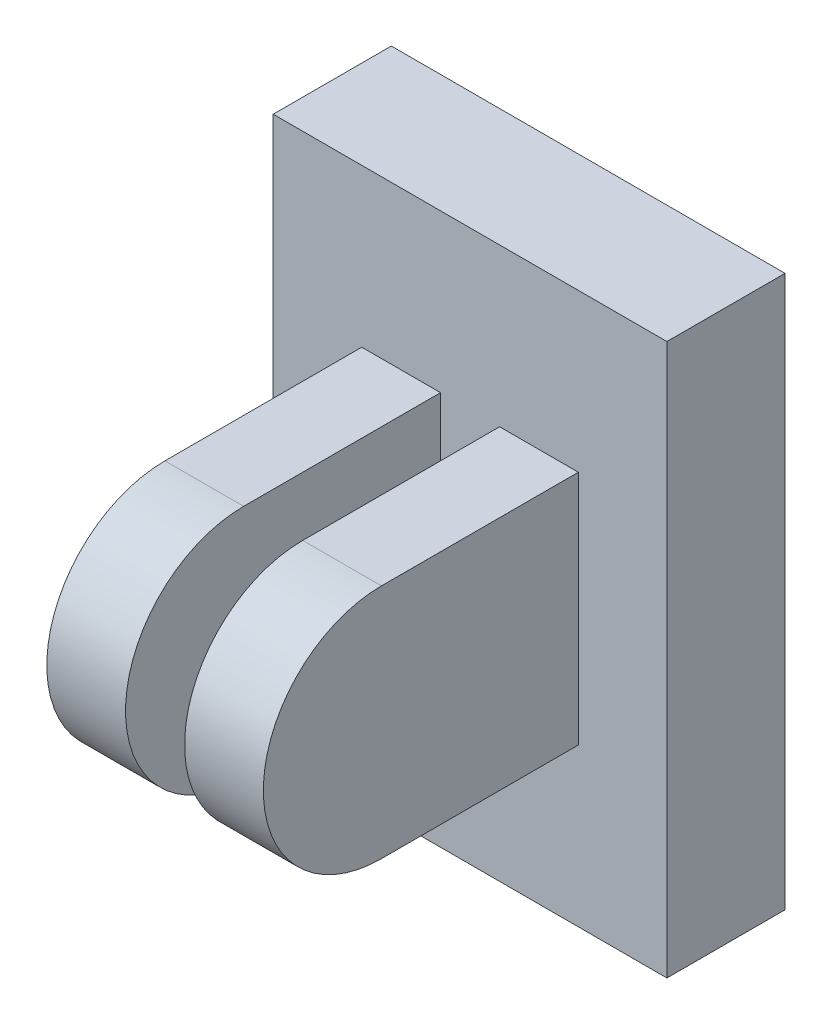
ISO-10303-21;
HEADER;
FILE_DESCRIPTION(('STEP AP214'),'2;1');
FILE_NAME('part.step','',(''),(''),'','','');
FILE_SCHEMA(('AUTOMOTIVE_DESIGN { 1 0 10303 214 1 1 1 1 }'));
ENDSEC;
DATA;
#1=APPLICATION_CONTEXT('core data for automotive mechanical design processes');
#2=APPLICATION_PROTOCOL_DEFINITION('international standard','automotive_design',2000,#1);
#3=PRODUCT_CONTEXT('',#1,'mechanical');
#4=PRODUCT('Part','Part','',(#3));
#5=PRODUCT_RELATED_PRODUCT_CATEGORY('part','',(#4));
#6=PRODUCT_DEFINITION_FORMATION('','',#4);
#7=PRODUCT_DEFINITION_CONTEXT('part definition',#1,'design');
#8=PRODUCT_DEFINITION('design','',#6,#7);
#9=PRODUCT_DEFINITION_SHAPE('','',#8);
#10=(LENGTH_UNIT() NAMED_UNIT(*) SI_UNIT(.MILLI.,.METRE.));
#11=(NAMED_UNIT(*) PLANE_ANGLE_UNIT() SI_UNIT($,.RADIAN.));
#12=(NAMED_UNIT(*) SI_UNIT($,.STERADIAN.) SOLID_ANGLE_UNIT());
#13=UNCERTAINTY_MEASURE_WITH_UNIT(LENGTH_MEASURE(1.E-05),#10,'distance_accuracy_value','');
#14=(GEOMETRIC_REPRESENTATION_CONTEXT(3) GLOBAL_UNCERTAINTY_ASSIGNED_CONTEXT((#13)) GLOBAL_UNIT_ASSIGNED_CONTEXT((#10,
#11,#12)) REPRESENTATION_CONTEXT('',''));
#15=CARTESIAN_POINT('',(0.,0.,0.));
#16=DIRECTION('',(0.,0.,1.));
#17=DIRECTION('',(1.,0.,0.));
#18=AXIS2_PLACEMENT_3D('',#15,#16,#17);
#19=CARTESIAN_POINT('',(4.365625,0.,12.7));
#20=DIRECTION('',(-1.,0.,0.));
#21=DIRECTION('',(0.,0.,1.));
#22=AXIS2_PLACEMENT_3D('',#19,#20,#21);
#23=CYLINDRICAL_SURFACE('',#22,4.7625);
#24=CARTESIAN_POINT('',(1.190625,0.,12.7));
#25=DIRECTION('',(-1.,0.,0.));
#26=DIRECTION('',(0.,0.,1.));
#27=AXIS2_PLACEMENT_3D('',#24,#25,#26);
#28=CIRCLE('',#27,4.7625);
#29=CARTESIAN_POINT('',(1.190625,-4.7625,12.7));
#30=VERTEX_POINT('',#29);
#31=CARTESIAN_POINT('',(1.190625,4.7625,12.7));
#32=VERTEX_POINT('',#31);
#33=EDGE_CURVE('E33',#30,#32,#28,.T.);
#34=ORIENTED_EDGE('',*,*,#33,.F.);
#35=DIRECTION('',(1.,0.,0.));
#36=VECTOR('',#35,1.);
#37=CARTESIAN_POINT('',(4.365625,-4.7625,12.7));
#38=LINE('',#37,#36);
#39=CARTESIAN_POINT('',(4.365625,-4.7625,12.7));
#40=VERTEX_POINT('',#39);
#41=EDGE_CURVE('E9',#30,#40,#38,.T.);
#42=ORIENTED_EDGE('',*,*,#41,.T.);
#43=CARTESIAN_POINT('',(4.365625,0.,12.7));
#44=DIRECTION('',(1.,0.,0.));
#45=DIRECTION('',(0.,1.,0.));
#46=AXIS2_PLACEMENT_3D('',#43,#44,#45);
#47=CIRCLE('',#46,4.7625);
#48=CARTESIAN_POINT('',(4.365625,4.7625,12.7));
#49=VERTEX_POINT('',#48);
#50=EDGE_CURVE('E178',#49,#40,#47,.T.);
#51=ORIENTED_EDGE('',*,*,#50,.F.);
#52=DIRECTION('',(1.,0.,0.));
#53=VECTOR('',#52,1.);
#54=CARTESIAN_POINT('',(4.365625,4.7625,12.7));
#55=LINE('',#54,#53);
#56=EDGE_CURVE('E177',#32,#49,#55,.T.);
#57=ORIENTED_EDGE('',*,*,#56,.F.);
#58=EDGE_LOOP('',(#34,#42,#51,#57));
#59=FACE_BOUND('',#58,.T.);
#60=ADVANCED_FACE('F15',(#59),#23,.T.);
#61=CARTESIAN_POINT('',(4.365625,0.,12.7));
#62=DIRECTION('',(-1.,0.,0.));
#63=DIRECTION('',(0.,0.,1.));
#64=AXIS2_PLACEMENT_3D('',#61,#62,#63);
#65=CYLINDRICAL_SURFACE('',#64,4.7625);
#66=CARTESIAN_POINT('',(-1.190625,0.,12.7));
#67=DIRECTION('',(1.,0.,0.));
#68=DIRECTION('',(0.,1.,0.));
#69=AXIS2_PLACEMENT_3D('',#66,#67,#68);
#70=CIRCLE('',#69,4.7625);
#71=CARTESIAN_POINT('',(-1.190625,4.7625,12.7));
#72=VERTEX_POINT('',#71);
#73=CARTESIAN_POINT('',(-1.190625,-4.7625,12.7));
#74=VERTEX_POINT('',#73);
#75=EDGE_CURVE('E151',#72,#74,#70,.T.);
#76=ORIENTED_EDGE('',*,*,#75,.F.);
#77=DIRECTION('',(1.,0.,0.));
#78=VECTOR('',#77,1.);
#79=CARTESIAN_POINT('',(4.365625,4.7625,12.7));
#80=LINE('',#79,#78);
#81=CARTESIAN_POINT('',(-4.365625,4.7625,12.7));
#82=VERTEX_POINT('',#81);
#83=EDGE_CURVE('E168',#82,#72,#80,.T.);
#84=ORIENTED_EDGE('',*,*,#83,.F.);
#85=CARTESIAN_POINT('',(-4.365625,0.,12.7));
#86=DIRECTION('',(-1.,0.,0.));
#87=DIRECTION('',(0.,0.,1.));
#88=AXIS2_PLACEMENT_3D('',#85,#86,#87);
#89=CIRCLE('',#88,4.7625);
#90=CARTESIAN_POINT('',(-4.365625,-4.7625,12.7));
#91=VERTEX_POINT('',#90);
#92=EDGE_CURVE('E188',#91,#82,#89,.T.);
#93=ORIENTED_EDGE('',*,*,#92,.F.);
#94=DIRECTION('',(1.,0.,0.));
#95=VECTOR('',#94,1.);
#96=CARTESIAN_POINT('',(4.365625,-4.7625,12.7));
#97=LINE('',#96,#95);
#98=EDGE_CURVE('E25',#91,#74,#97,.T.);
#99=ORIENTED_EDGE('',*,*,#98,.T.);
#100=EDGE_LOOP('',(#76,#84,#93,#99));
#101=FACE_BOUND('',#100,.T.);
#102=ADVANCED_FACE('F17',(#101),#65,.T.);
#103=CARTESIAN_POINT('',(-1.190625,-4.7625,4.7625));
#104=DIRECTION('',(0.,-1.,0.));
#105=DIRECTION('',(0.,0.,-1.));
#106=AXIS2_PLACEMENT_3D('',#103,#104,#105);
#107=PLANE('',#106);
#108=ORIENTED_EDGE('',*,*,#98,.F.);
#109=DIRECTION('',(0.,0.,1.));
#110=VECTOR('',#109,1.);
#111=CARTESIAN_POINT('',(-4.365625,-4.7625,4.7625));
#112=LINE('',#111,#110);
#113=CARTESIAN_POINT('',(-4.365625,-4.7625,4.7625));
#114=VERTEX_POINT('',#113);
#115=EDGE_CURVE('E190',#114,#91,#112,.T.);
#116=ORIENTED_EDGE('',*,*,#115,.F.);
#117=DIRECTION('',(-1.,0.,0.));
#118=VECTOR('',#117,1.);
#119=CARTESIAN_POINT('',(-0.5953125,-4.7625,4.7625));
#120=LINE('',#119,#118);
#121=CARTESIAN_POINT('',(-1.190625,-4.7625,4.7625));
#122=VERTEX_POINT('',#121);
#123=EDGE_CURVE('E127',#122,#114,#120,.T.);
#124=ORIENTED_EDGE('',*,*,#123,.F.);
#125=DIRECTION('',(0.,0.,1.));
#126=VECTOR('',#125,1.);
#127=CARTESIAN_POINT('',(-1.190625,-4.7625,4.7625));
#128=LINE('',#127,#126);
#129=EDGE_CURVE('E185',#122,#74,#128,.T.);
#130=ORIENTED_EDGE('',*,*,#129,.T.);
#131=EDGE_LOOP('',(#108,#116,#124,#130));
#132=FACE_BOUND('',#131,.T.);
#133=ADVANCED_FACE('F234',(#132),#107,.T.);
#134=CARTESIAN_POINT('',(-4.365625,-4.7625,4.7625));
#135=DIRECTION('',(-1.,0.,0.));
#136=DIRECTION('',(0.,0.,1.));
#137=AXIS2_PLACEMENT_3D('',#134,#135,#136);
#138=PLANE('',#137);
#139=ORIENTED_EDGE('',*,*,#92,.T.);
#140=DIRECTION('',(0.,0.,1.));
#141=VECTOR('',#140,1.);
#142=CARTESIAN_POINT('',(-4.365625,4.7625,4.7625));
#143=LINE('',#142,#141);
#144=CARTESIAN_POINT('',(-4.365625,4.7625,4.7625));
#145=VERTEX_POINT('',#144);
#146=EDGE_CURVE('E182',#145,#82,#143,.T.);
#147=ORIENTED_EDGE('',*,*,#146,.F.);
#148=DIRECTION('',(0.,1.,0.));
#149=VECTOR('',#148,1.);
#150=CARTESIAN_POINT('',(-4.365625,-2.38125,4.7625));
#151=LINE('',#150,#149);
#152=EDGE_CURVE('E125',#114,#145,#151,.T.);
#153=ORIENTED_EDGE('',*,*,#152,.F.);
#154=ORIENTED_EDGE('',*,*,#115,.T.);
#155=EDGE_LOOP('',(#139,#147,#153,#154));
#156=FACE_BOUND('',#155,.T.);
#157=ADVANCED_FACE('F228',(#156),#138,.T.);
#158=CARTESIAN_POINT('',(1.190625,4.7625,4.7625));
#159=DIRECTION('',(0.,1.,0.));
#160=DIRECTION('',(0.,0.,1.));
#161=AXIS2_PLACEMENT_3D('',#158,#159,#160);
#162=PLANE('',#161);
#163=ORIENTED_EDGE('',*,*,#56,.T.);
#164=DIRECTION('',(0.,0.,1.));
#165=VECTOR('',#164,1.);
#166=CARTESIAN_POINT('',(4.365625,4.7625,4.7625));
#167=LINE('',#166,#165);
#168=CARTESIAN_POINT('',(4.365625,4.7625,4.7625));
#169=VERTEX_POINT('',#168);
#170=EDGE_CURVE('E173',#169,#49,#167,.T.);
#171=ORIENTED_EDGE('',*,*,#170,.F.);
#172=DIRECTION('',(1.,0.,0.));
#173=VECTOR('',#172,1.);
#174=CARTESIAN_POINT('',(0.5953125,4.7625,4.7625));
#175=LINE('',#174,#173);
#176=CARTESIAN_POINT('',(1.190625,4.7625,4.7625));
#177=VERTEX_POINT('',#176);
#178=EDGE_CURVE('E163',#177,#169,#175,.T.);
#179=ORIENTED_EDGE('',*,*,#178,.F.);
#180=DIRECTION('',(0.,0.,1.));
#181=VECTOR('',#180,1.);
#182=CARTESIAN_POINT('',(1.190625,4.7625,4.7625));
#183=LINE('',#182,#181);
#184=EDGE_CURVE('E174',#177,#32,#183,.T.);
#185=ORIENTED_EDGE('',*,*,#184,.T.);
#186=EDGE_LOOP('',(#163,#171,#179,#185));
#187=FACE_BOUND('',#186,.T.);
#188=ADVANCED_FACE('F210',(#187),#162,.T.);
#189=CARTESIAN_POINT('',(4.365625,4.7625,4.7625));
#190=DIRECTION('',(1.,0.,0.));
#191=DIRECTION('',(0.,0.,-1.));
#192=AXIS2_PLACEMENT_3D('',#189,#190,#191);
#193=PLANE('',#192);
#194=ORIENTED_EDGE('',*,*,#50,.T.);
#195=DIRECTION('',(0.,0.,1.));
#196=VECTOR('',#195,1.);
#197=CARTESIAN_POINT('',(4.365625,-4.7625,4.7625));
#198=LINE('',#197,#196);
#199=CARTESIAN_POINT('',(4.365625,-4.7625,4.7625));
#200=VERTEX_POINT('',#199);
#201=EDGE_CURVE('E170',#200,#40,#198,.T.);
#202=ORIENTED_EDGE('',*,*,#201,.F.);
#203=DIRECTION('',(0.,-1.,0.));
#204=VECTOR('',#203,1.);
#205=CARTESIAN_POINT('',(4.365625,2.38125,4.7625));
#206=LINE('',#205,#204);
#207=EDGE_CURVE('E158',#169,#200,#206,.T.);
#208=ORIENTED_EDGE('',*,*,#207,.F.);
#209=ORIENTED_EDGE('',*,*,#170,.T.);
#210=EDGE_LOOP('',(#194,#202,#208,#209));
#211=FACE_BOUND('',#210,.T.);
#212=ADVANCED_FACE('F219',(#211),#193,.T.);
#213=CARTESIAN_POINT('',(4.365625,-4.7625,4.7625));
#214=DIRECTION('',(0.,-1.,0.));
#215=DIRECTION('',(0.,0.,-1.));
#216=AXIS2_PLACEMENT_3D('',#213,#214,#215);
#217=PLANE('',#216);
#218=ORIENTED_EDGE('',*,*,#41,.F.);
#219=DIRECTION('',(0.,0.,1.));
#220=VECTOR('',#219,1.);
#221=CARTESIAN_POINT('',(1.190625,-4.7625,4.7625));
#222=LINE('',#221,#220);
#223=CARTESIAN_POINT('',(1.190625,-4.7625,4.7625));
#224=VERTEX_POINT('',#223);
#225=EDGE_CURVE('E165',#224,#30,#222,.T.);
#226=ORIENTED_EDGE('',*,*,#225,.F.);
#227=DIRECTION('',(-1.,0.,0.));
#228=VECTOR('',#227,1.);
#229=CARTESIAN_POINT('',(2.1828125,-4.7625,4.7625));
#230=LINE('',#229,#228);
#231=EDGE_CURVE('E120',#200,#224,#230,.T.);
#232=ORIENTED_EDGE('',*,*,#231,.F.);
#233=ORIENTED_EDGE('',*,*,#201,.T.);
#234=EDGE_LOOP('',(#218,#226,#232,#233));
#235=FACE_BOUND('',#234,.T.);
#236=ADVANCED_FACE('F217',(#235),#217,.T.);
#237=CARTESIAN_POINT('',(1.190625,-4.7625,4.7625));
#238=DIRECTION('',(-1.,0.,0.));
#239=DIRECTION('',(0.,0.,1.));
#240=AXIS2_PLACEMENT_3D('',#237,#238,#239);
#241=PLANE('',#240);
#242=ORIENTED_EDGE('',*,*,#33,.T.);
#243=ORIENTED_EDGE('',*,*,#184,.F.);
#244=DIRECTION('',(0.,1.,0.));
#245=VECTOR('',#244,1.);
#246=CARTESIAN_POINT('',(1.190625,-2.38125,4.7625));
#247=LINE('',#246,#245);
#248=EDGE_CURVE('E160',#224,#177,#247,.T.);
#249=ORIENTED_EDGE('',*,*,#248,.F.);
#250=ORIENTED_EDGE('',*,*,#225,.T.);
#251=EDGE_LOOP('',(#242,#243,#249,#250));
#252=FACE_BOUND('',#251,.T.);
#253=ADVANCED_FACE('F205',(#252),#241,.T.);
#254=CARTESIAN_POINT('',(-4.365625,4.7625,4.7625));
#255=DIRECTION('',(0.,1.,0.));
#256=DIRECTION('',(0.,0.,1.));
#257=AXIS2_PLACEMENT_3D('',#254,#255,#256);
#258=PLANE('',#257);
#259=ORIENTED_EDGE('',*,*,#83,.T.);
#260=DIRECTION('',(0.,0.,1.));
#261=VECTOR('',#260,1.);
#262=CARTESIAN_POINT('',(-1.190625,4.7625,4.7625));
#263=LINE('',#262,#261);
#264=CARTESIAN_POINT('',(-1.190625,4.7625,4.7625));
#265=VERTEX_POINT('',#264);
#266=EDGE_CURVE('E149',#265,#72,#263,.T.);
#267=ORIENTED_EDGE('',*,*,#266,.F.);
#268=DIRECTION('',(1.,0.,0.));
#269=VECTOR('',#268,1.);
#270=CARTESIAN_POINT('',(-2.1828125,4.7625,4.7625));
#271=LINE('',#270,#269);
#272=EDGE_CURVE('E157',#145,#265,#271,.T.);
#273=ORIENTED_EDGE('',*,*,#272,.F.);
#274=ORIENTED_EDGE('',*,*,#146,.T.);
#275=EDGE_LOOP('',(#259,#267,#273,#274));
#276=FACE_BOUND('',#275,.T.);
#277=ADVANCED_FACE('F255',(#276),#258,.T.);
#278=CARTESIAN_POINT('',(-1.190625,4.7625,4.7625));
#279=DIRECTION('',(1.,0.,0.));
#280=DIRECTION('',(0.,0.,-1.));
#281=AXIS2_PLACEMENT_3D('',#278,#279,#280);
#282=PLANE('',#281);
#283=ORIENTED_EDGE('',*,*,#75,.T.);
#284=ORIENTED_EDGE('',*,*,#129,.F.);
#285=DIRECTION('',(0.,-1.,0.));
#286=VECTOR('',#285,1.);
#287=CARTESIAN_POINT('',(-1.190625,2.38125,4.7625));
#288=LINE('',#287,#286);
#289=EDGE_CURVE('E154',#265,#122,#288,.T.);
#290=ORIENTED_EDGE('',*,*,#289,.F.);
#291=ORIENTED_EDGE('',*,*,#266,.T.);
#292=EDGE_LOOP('',(#283,#284,#290,#291));
#293=FACE_BOUND('',#292,.T.);
#294=ADVANCED_FACE('F252',(#293),#282,.T.);
#295=CARTESIAN_POINT('',(7.9375,11.1125,0.));
#296=DIRECTION('',(1.,0.,0.));
#297=DIRECTION('',(0.,1.,0.));
#298=AXIS2_PLACEMENT_3D('',#295,#296,#297);
#299=PLANE('',#298);
#300=DIRECTION('',(0.,-1.,0.));
#301=VECTOR('',#300,1.);
#302=CARTESIAN_POINT('',(7.9375,11.1125,4.7625));
#303=LINE('',#302,#301);
#304=CARTESIAN_POINT('',(7.9375,11.1125,4.7625));
#305=VERTEX_POINT('',#304);
#306=CARTESIAN_POINT('',(7.9375,-11.1125,4.7625));
#307=VERTEX_POINT('',#306);
#308=EDGE_CURVE('E137',#305,#307,#303,.T.);
#309=ORIENTED_EDGE('',*,*,#308,.T.);
#310=DIRECTION('',(0.,0.,1.));
#311=VECTOR('',#310,1.);
#312=CARTESIAN_POINT('',(7.9375,-11.1125,0.));
#313=LINE('',#312,#311);
#314=CARTESIAN_POINT('',(7.9375,-11.1125,0.));
#315=VERTEX_POINT('',#314);
#316=EDGE_CURVE('E134',#315,#307,#313,.T.);
#317=ORIENTED_EDGE('',*,*,#316,.F.);
#318=DIRECTION('',(0.,-1.,0.));
#319=VECTOR('',#318,1.);
#320=CARTESIAN_POINT('',(7.9375,11.1125,0.));
#321=LINE('',#320,#319);
#322=CARTESIAN_POINT('',(7.9375,11.1125,0.));
#323=VERTEX_POINT('',#322);
#324=EDGE_CURVE('E126',#323,#315,#321,.T.);
#325=ORIENTED_EDGE('',*,*,#324,.F.);
#326=DIRECTION('',(0.,0.,1.));
#327=VECTOR('',#326,1.);
#328=CARTESIAN_POINT('',(7.9375,11.1125,0.));
#329=LINE('',#328,#327);
#330=EDGE_CURVE('E124',#323,#305,#329,.T.);
#331=ORIENTED_EDGE('',*,*,#330,.T.);
#332=EDGE_LOOP('',(#309,#317,#325,#331));
#333=FACE_BOUND('',#332,.T.);
#334=ADVANCED_FACE('F248',(#333),#299,.T.);
#335=CARTESIAN_POINT('',(7.9375,-11.1125,0.));
#336=DIRECTION('',(0.,-1.,0.));
#337=DIRECTION('',(0.,0.,-1.));
#338=AXIS2_PLACEMENT_3D('',#335,#336,#337);
#339=PLANE('',#338);
#340=DIRECTION('',(-1.,0.,0.));
#341=VECTOR('',#340,1.);
#342=CARTESIAN_POINT('',(7.9375,-11.1125,4.7625));
#343=LINE('',#342,#341);
#344=CARTESIAN_POINT('',(-7.9375,-11.1125,4.7625));
#345=VERTEX_POINT('',#344);
#346=EDGE_CURVE('E138',#307,#345,#343,.T.);
#347=ORIENTED_EDGE('',*,*,#346,.T.);
#348=DIRECTION('',(0.,0.,1.));
#349=VECTOR('',#348,1.);
#350=CARTESIAN_POINT('',(-7.9375,-11.1125,0.));
#351=LINE('',#350,#349);
#352=CARTESIAN_POINT('',(-7.9375,-11.1125,0.));
#353=VERTEX_POINT('',#352);
#354=EDGE_CURVE('E141',#353,#345,#351,.T.);
#355=ORIENTED_EDGE('',*,*,#354,.F.);
#356=DIRECTION('',(-1.,0.,0.));
#357=VECTOR('',#356,1.);
#358=CARTESIAN_POINT('',(7.9375,-11.1125,0.));
#359=LINE('',#358,#357);
#360=EDGE_CURVE('E111',#315,#353,#359,.T.);
#361=ORIENTED_EDGE('',*,*,#360,.F.);
#362=ORIENTED_EDGE('',*,*,#316,.T.);
#363=EDGE_LOOP('',(#347,#355,#361,#362));
#364=FACE_BOUND('',#363,.T.);
#365=ADVANCED_FACE('F245',(#364),#339,.T.);
#366=CARTESIAN_POINT('',(-7.9375,-11.1125,0.));
#367=DIRECTION('',(-1.,0.,0.));
#368=DIRECTION('',(0.,-1.,0.));
#369=AXIS2_PLACEMENT_3D('',#366,#367,#368);
#370=PLANE('',#369);
#371=DIRECTION('',(0.,1.,0.));
#372=VECTOR('',#371,1.);
#373=CARTESIAN_POINT('',(-7.9375,-11.1125,4.7625));
#374=LINE('',#373,#372);
#375=CARTESIAN_POINT('',(-7.9375,11.1125,4.7625));
#376=VERTEX_POINT('',#375);
#377=EDGE_CURVE('E117',#345,#376,#374,.T.);
#378=ORIENTED_EDGE('',*,*,#377,.T.);
#379=DIRECTION('',(0.,0.,1.));
#380=VECTOR('',#379,1.);
#381=CARTESIAN_POINT('',(-7.9375,11.1125,0.));
#382=LINE('',#381,#380);
#383=CARTESIAN_POINT('',(-7.9375,11.1125,0.));
#384=VERTEX_POINT('',#383);
#385=EDGE_CURVE('E102',#384,#376,#382,.T.);
#386=ORIENTED_EDGE('',*,*,#385,.F.);
#387=DIRECTION('',(0.,1.,0.));
#388=VECTOR('',#387,1.);
#389=CARTESIAN_POINT('',(-7.9375,-11.1125,0.));
#390=LINE('',#389,#388);
#391=EDGE_CURVE('E108',#353,#384,#390,.T.);
#392=ORIENTED_EDGE('',*,*,#391,.F.);
#393=ORIENTED_EDGE('',*,*,#354,.T.);
#394=EDGE_LOOP('',(#378,#386,#392,#393));
#395=FACE_BOUND('',#394,.T.);
#396=ADVANCED_FACE('F115',(#395),#370,.T.);
#397=CARTESIAN_POINT('',(-7.9375,11.1125,0.));
#398=DIRECTION('',(0.,1.,0.));
#399=DIRECTION('',(0.,0.,1.));
#400=AXIS2_PLACEMENT_3D('',#397,#398,#399);
#401=PLANE('',#400);
#402=DIRECTION('',(1.,0.,0.));
#403=VECTOR('',#402,1.);
#404=CARTESIAN_POINT('',(-7.9375,11.1125,4.7625));
#405=LINE('',#404,#403);
#406=EDGE_CURVE('E119',#376,#305,#405,.T.);
#407=ORIENTED_EDGE('',*,*,#406,.T.);
#408=ORIENTED_EDGE('',*,*,#330,.F.);
#409=DIRECTION('',(1.,0.,0.));
#410=VECTOR('',#409,1.);
#411=CARTESIAN_POINT('',(-7.9375,11.1125,0.));
#412=LINE('',#411,#410);
#413=EDGE_CURVE('E19',#384,#323,#412,.T.);
#414=ORIENTED_EDGE('',*,*,#413,.F.);
#415=ORIENTED_EDGE('',*,*,#385,.T.);
#416=EDGE_LOOP('',(#407,#408,#414,#415));
#417=FACE_BOUND('',#416,.T.);
#418=ADVANCED_FACE('F123',(#417),#401,.T.);
#419=CARTESIAN_POINT('',(0.,0.,4.7625));
#420=DIRECTION('',(0.,0.,1.));
#421=DIRECTION('',(1.,0.,0.));
#422=AXIS2_PLACEMENT_3D('',#419,#420,#421);
#423=PLANE('',#422);
#424=ORIENTED_EDGE('',*,*,#231,.T.);
#425=ORIENTED_EDGE('',*,*,#248,.T.);
#426=ORIENTED_EDGE('',*,*,#178,.T.);
#427=ORIENTED_EDGE('',*,*,#207,.T.);
#428=EDGE_LOOP('',(#424,#425,#426,#427));
#429=FACE_BOUND('',#428,.T.);
#430=ORIENTED_EDGE('',*,*,#272,.T.);
#431=ORIENTED_EDGE('',*,*,#289,.T.);
#432=ORIENTED_EDGE('',*,*,#123,.T.);
#433=ORIENTED_EDGE('',*,*,#152,.T.);
#434=EDGE_LOOP('',(#430,#431,#432,#433));
#435=FACE_BOUND('',#434,.T.);
#436=ORIENTED_EDGE('',*,*,#308,.F.);
#437=ORIENTED_EDGE('',*,*,#406,.F.);
#438=ORIENTED_EDGE('',*,*,#377,.F.);
#439=ORIENTED_EDGE('',*,*,#346,.F.);
#440=EDGE_LOOP('',(#436,#437,#438,#439));
#441=FACE_BOUND('',#440,.T.);
#442=ADVANCED_FACE('F145',(#429,#435,#441),#423,.T.);
#443=CARTESIAN_POINT('',(0.,0.,0.));
#444=DIRECTION('',(0.,0.,1.));
#445=DIRECTION('',(1.,0.,0.));
#446=AXIS2_PLACEMENT_3D('',#443,#444,#445);
#447=PLANE('',#446);
#448=ORIENTED_EDGE('',*,*,#413,.T.);
#449=ORIENTED_EDGE('',*,*,#324,.T.);
#450=ORIENTED_EDGE('',*,*,#360,.T.);
#451=ORIENTED_EDGE('',*,*,#391,.T.);
#452=EDGE_LOOP('',(#448,#449,#450,#451));
#453=FACE_BOUND('',#452,.T.);
#454=ADVANCED_FACE('F109',(#453),#447,.F.);
#455=CLOSED_SHELL('',(#60,#102,#133,#157,#188,#212,#236,#253,#277,#294,#334,#365,#396,#418,#442,#454));
#456=MANIFOLD_SOLID_BREP('B1',#455);
#457=ADVANCED_BREP_SHAPE_REPRESENTATION('',(#18,#456),#14);
#458=SHAPE_DEFINITION_REPRESENTATION(#9,#457);
ENDSEC;
END-ISO-10303-21;
